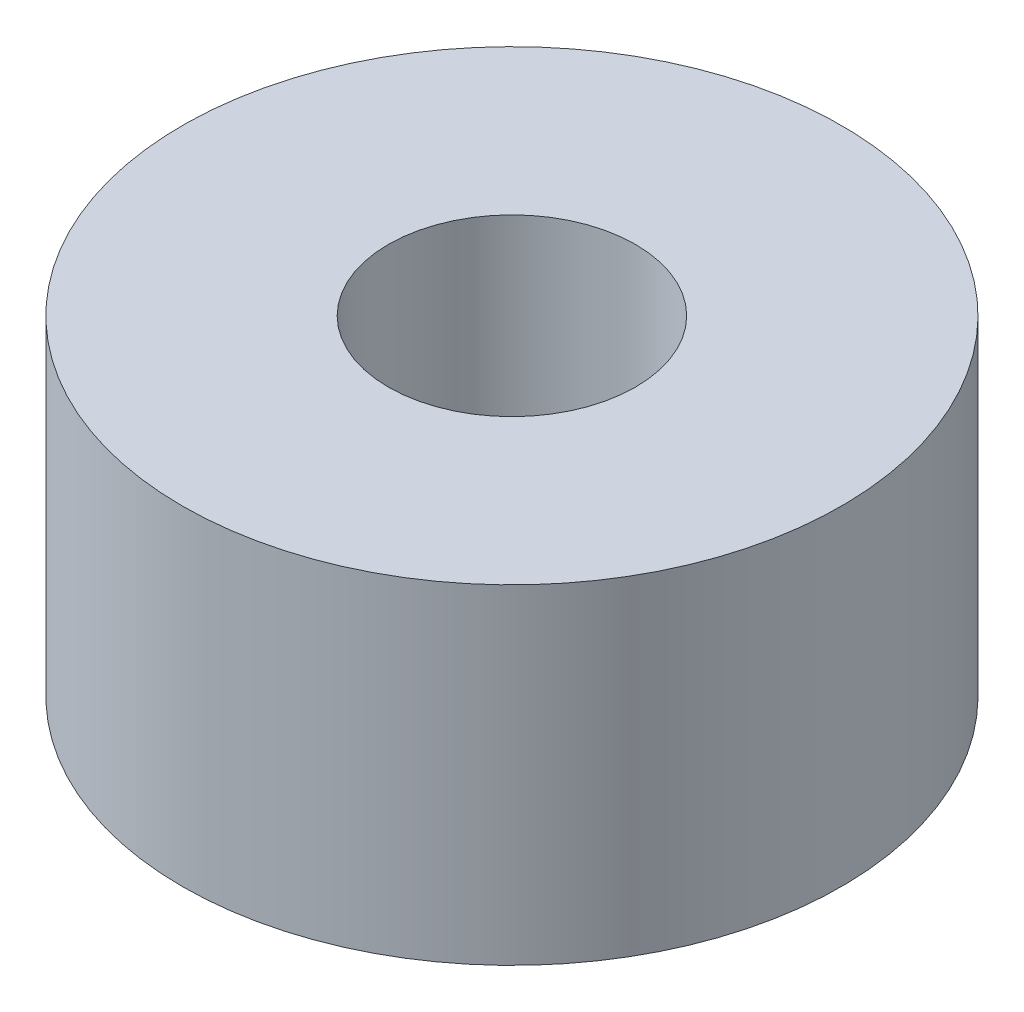
ISO-10303-21;
HEADER;
FILE_DESCRIPTION(('STEP AP214'),'2;1');
FILE_NAME('part.step','',(''),(''),'','','');
FILE_SCHEMA(('AUTOMOTIVE_DESIGN { 1 0 10303 214 1 1 1 1 }'));
ENDSEC;
DATA;
#1=APPLICATION_CONTEXT('core data for automotive mechanical design processes');
#2=APPLICATION_PROTOCOL_DEFINITION('international standard','automotive_design',2000,#1);
#3=PRODUCT_CONTEXT('',#1,'mechanical');
#4=PRODUCT('Part','Part','',(#3));
#5=PRODUCT_RELATED_PRODUCT_CATEGORY('part','',(#4));
#6=PRODUCT_DEFINITION_FORMATION('','',#4);
#7=PRODUCT_DEFINITION_CONTEXT('part definition',#1,'design');
#8=PRODUCT_DEFINITION('design','',#6,#7);
#9=PRODUCT_DEFINITION_SHAPE('','',#8);
#10=(LENGTH_UNIT() NAMED_UNIT(*) SI_UNIT(.MILLI.,.METRE.));
#11=(NAMED_UNIT(*) PLANE_ANGLE_UNIT() SI_UNIT($,.RADIAN.));
#12=(NAMED_UNIT(*) SI_UNIT($,.STERADIAN.) SOLID_ANGLE_UNIT());
#13=UNCERTAINTY_MEASURE_WITH_UNIT(LENGTH_MEASURE(1.E-05),#10,'distance_accuracy_value','');
#14=(GEOMETRIC_REPRESENTATION_CONTEXT(3) GLOBAL_UNCERTAINTY_ASSIGNED_CONTEXT((#13)) GLOBAL_UNIT_ASSIGNED_CONTEXT((#10,
#11,#12)) REPRESENTATION_CONTEXT('',''));
#15=CARTESIAN_POINT('',(0.,0.,0.));
#16=DIRECTION('',(0.,0.,1.));
#17=DIRECTION('',(1.,0.,0.));
#18=AXIS2_PLACEMENT_3D('',#15,#16,#17);
#19=CARTESIAN_POINT('',(0.,10.,0.));
#20=DIRECTION('',(0.,-1.,0.));
#21=DIRECTION('',(0.,0.,-1.));
#22=AXIS2_PLACEMENT_3D('',#19,#20,#21);
#23=CYLINDRICAL_SURFACE('',#22,10.);
#24=CARTESIAN_POINT('',(0.,10.,0.));
#25=DIRECTION('',(0.,1.,0.));
#26=DIRECTION('',(0.,0.,1.));
#27=AXIS2_PLACEMENT_3D('',#24,#25,#26);
#28=CIRCLE('',#27,10.);
#29=CARTESIAN_POINT('',(0.,10.,10.));
#30=VERTEX_POINT('',#29);
#31=EDGE_CURVE('E10',#30,#30,#28,.T.);
#32=ORIENTED_EDGE('',*,*,#31,.F.);
#33=EDGE_LOOP('',(#32));
#34=FACE_BOUND('',#33,.T.);
#35=CARTESIAN_POINT('',(0.,0.,0.));
#36=DIRECTION('',(0.,1.,0.));
#37=DIRECTION('',(0.,0.,1.));
#38=AXIS2_PLACEMENT_3D('',#35,#36,#37);
#39=CIRCLE('',#38,10.);
#40=CARTESIAN_POINT('',(0.,0.,10.));
#41=VERTEX_POINT('',#40);
#42=EDGE_CURVE('E40',#41,#41,#39,.T.);
#43=ORIENTED_EDGE('',*,*,#42,.T.);
#44=EDGE_LOOP('',(#43));
#45=FACE_BOUND('',#44,.T.);
#46=ADVANCED_FACE('F37',(#34,#45),#23,.T.);
#47=CARTESIAN_POINT('',(0.,10.,0.));
#48=DIRECTION('',(0.,1.,0.));
#49=DIRECTION('',(0.,0.,1.));
#50=AXIS2_PLACEMENT_3D('',#47,#48,#49);
#51=PLANE('',#50);
#52=CARTESIAN_POINT('',(0.,10.,0.));
#53=DIRECTION('',(0.,1.,0.));
#54=DIRECTION('',(0.,0.,1.));
#55=AXIS2_PLACEMENT_3D('',#52,#53,#54);
#56=CIRCLE('',#55,3.75);
#57=CARTESIAN_POINT('',(0.,10.,3.75));
#58=VERTEX_POINT('',#57);
#59=EDGE_CURVE('E49',#58,#58,#56,.T.);
#60=ORIENTED_EDGE('',*,*,#59,.F.);
#61=EDGE_LOOP('',(#60));
#62=FACE_BOUND('',#61,.T.);
#63=ORIENTED_EDGE('',*,*,#31,.T.);
#64=EDGE_LOOP('',(#63));
#65=FACE_BOUND('',#64,.T.);
#66=ADVANCED_FACE('F69',(#62,#65),#51,.T.);
#67=CARTESIAN_POINT('',(0.,0.,0.));
#68=DIRECTION('',(0.,1.,0.));
#69=DIRECTION('',(0.,0.,1.));
#70=AXIS2_PLACEMENT_3D('',#67,#68,#69);
#71=PLANE('',#70);
#72=CARTESIAN_POINT('',(0.,0.,0.));
#73=DIRECTION('',(0.,1.,0.));
#74=DIRECTION('',(0.,0.,1.));
#75=AXIS2_PLACEMENT_3D('',#72,#73,#74);
#76=CIRCLE('',#75,3.75);
#77=CARTESIAN_POINT('',(0.,0.,3.75));
#78=VERTEX_POINT('',#77);
#79=EDGE_CURVE('E54',#78,#78,#76,.T.);
#80=ORIENTED_EDGE('',*,*,#79,.T.);
#81=EDGE_LOOP('',(#80));
#82=FACE_BOUND('',#81,.T.);
#83=ORIENTED_EDGE('',*,*,#42,.F.);
#84=EDGE_LOOP('',(#83));
#85=FACE_BOUND('',#84,.T.);
#86=ADVANCED_FACE('F59',(#82,#85),#71,.F.);
#87=CARTESIAN_POINT('',(0.,0.,0.));
#88=DIRECTION('',(0.,1.,0.));
#89=DIRECTION('',(0.,0.,1.));
#90=AXIS2_PLACEMENT_3D('',#87,#88,#89);
#91=CYLINDRICAL_SURFACE('',#90,3.75);
#92=ORIENTED_EDGE('',*,*,#59,.T.);
#93=EDGE_LOOP('',(#92));
#94=FACE_BOUND('',#93,.T.);
#95=ORIENTED_EDGE('',*,*,#79,.F.);
#96=EDGE_LOOP('',(#95));
#97=FACE_BOUND('',#96,.T.);
#98=ADVANCED_FACE('F62',(#94,#97),#91,.F.);
#99=CLOSED_SHELL('',(#46,#66,#86,#98));
#100=MANIFOLD_SOLID_BREP('B2',#99);
#101=ADVANCED_BREP_SHAPE_REPRESENTATION('',(#18,#100),#14);
#102=SHAPE_DEFINITION_REPRESENTATION(#9,#101);
ENDSEC;
END-ISO-10303-21;
